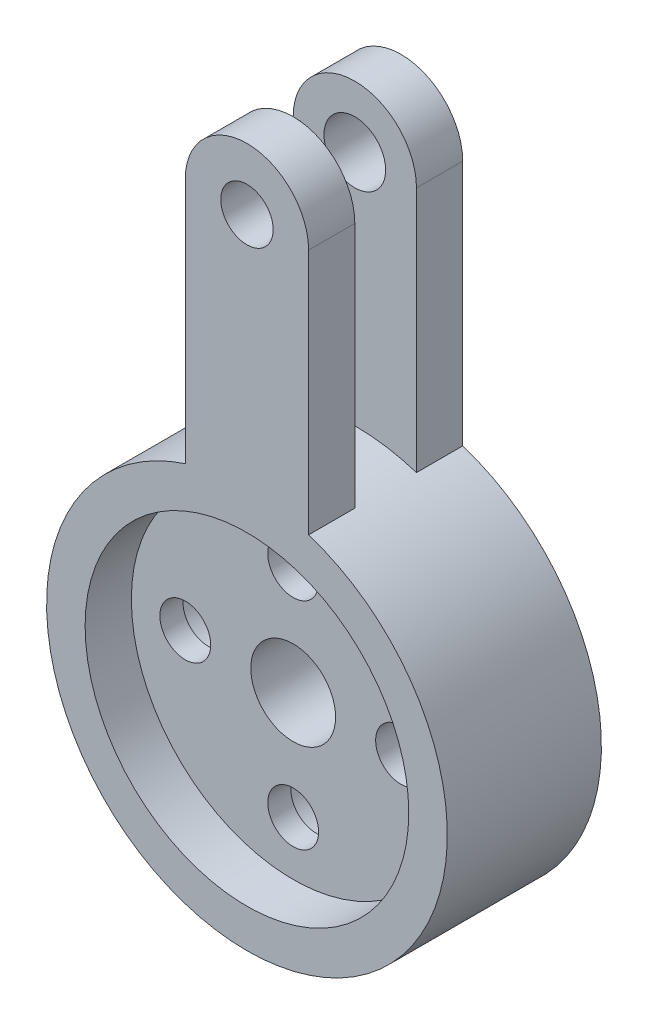
ISO-10303-21;
HEADER;
FILE_DESCRIPTION(('STEP AP214'),'2;1');
FILE_NAME('part.step','',(''),(''),'','','');
FILE_SCHEMA(('AUTOMOTIVE_DESIGN { 1 0 10303 214 1 1 1 1 }'));
ENDSEC;
DATA;
#1=APPLICATION_CONTEXT('core data for automotive mechanical design processes');
#2=APPLICATION_PROTOCOL_DEFINITION('international standard','automotive_design',2000,#1);
#3=PRODUCT_CONTEXT('',#1,'mechanical');
#4=PRODUCT('Part','Part','',(#3));
#5=PRODUCT_RELATED_PRODUCT_CATEGORY('part','',(#4));
#6=PRODUCT_DEFINITION_FORMATION('','',#4);
#7=PRODUCT_DEFINITION_CONTEXT('part definition',#1,'design');
#8=PRODUCT_DEFINITION('design','',#6,#7);
#9=PRODUCT_DEFINITION_SHAPE('','',#8);
#10=(LENGTH_UNIT() NAMED_UNIT(*) SI_UNIT(.MILLI.,.METRE.));
#11=(NAMED_UNIT(*) PLANE_ANGLE_UNIT() SI_UNIT($,.RADIAN.));
#12=(NAMED_UNIT(*) SI_UNIT($,.STERADIAN.) SOLID_ANGLE_UNIT());
#13=UNCERTAINTY_MEASURE_WITH_UNIT(LENGTH_MEASURE(1.E-05),#10,'distance_accuracy_value','');
#14=(GEOMETRIC_REPRESENTATION_CONTEXT(3) GLOBAL_UNCERTAINTY_ASSIGNED_CONTEXT((#13)) GLOBAL_UNIT_ASSIGNED_CONTEXT((#10,
#11,#12)) REPRESENTATION_CONTEXT('',''));
#15=CARTESIAN_POINT('',(0.,0.,0.));
#16=DIRECTION('',(0.,0.,1.));
#17=DIRECTION('',(1.,0.,0.));
#18=AXIS2_PLACEMENT_3D('',#15,#16,#17);
#19=CARTESIAN_POINT('',(0.,0.,10.));
#20=DIRECTION('',(0.,0.,-1.));
#21=DIRECTION('',(-1.,0.,0.));
#22=AXIS2_PLACEMENT_3D('',#19,#20,#21);
#23=CYLINDRICAL_SURFACE('',#22,13.);
#24=CARTESIAN_POINT('',(0.,0.,0.));
#25=DIRECTION('',(0.,0.,1.));
#26=DIRECTION('',(1.,0.,0.));
#27=AXIS2_PLACEMENT_3D('',#24,#25,#26);
#28=CIRCLE('',#27,13.);
#29=CARTESIAN_POINT('',(-4.,12.369316876853,0.));
#30=VERTEX_POINT('',#29);
#31=CARTESIAN_POINT('',(4.,12.369316876853,0.));
#32=VERTEX_POINT('',#31);
#33=EDGE_CURVE('E51',#30,#32,#28,.T.);
#34=ORIENTED_EDGE('',*,*,#33,.T.);
#35=DIRECTION('',(0.,0.,-1.));
#36=VECTOR('',#35,1.);
#37=CARTESIAN_POINT('',(4.,12.369316876853,3.));
#38=LINE('',#37,#36);
#39=CARTESIAN_POINT('',(4.,12.369316876853,3.));
#40=VERTEX_POINT('',#39);
#41=EDGE_CURVE('E154',#40,#32,#38,.T.);
#42=ORIENTED_EDGE('',*,*,#41,.F.);
#43=CARTESIAN_POINT('',(0.,-8.6389229103645E-13,3.));
#44=DIRECTION('',(0.,0.,1.));
#45=DIRECTION('',(1.,0.,0.));
#46=AXIS2_PLACEMENT_3D('',#43,#44,#45);
#47=CIRCLE('',#46,13.0000000000008);
#48=CARTESIAN_POINT('',(-4.,12.369316876853,3.));
#49=VERTEX_POINT('',#48);
#50=EDGE_CURVE('E133',#40,#49,#47,.T.);
#51=ORIENTED_EDGE('',*,*,#50,.T.);
#52=DIRECTION('',(0.,0.,-1.));
#53=VECTOR('',#52,1.);
#54=CARTESIAN_POINT('',(-4.,12.369316876853,3.));
#55=LINE('',#54,#53);
#56=EDGE_CURVE('E145',#49,#30,#55,.T.);
#57=ORIENTED_EDGE('',*,*,#56,.T.);
#58=EDGE_LOOP('',(#34,#42,#51,#57));
#59=FACE_BOUND('',#58,.T.);
#60=DIRECTION('',(0.,0.,1.));
#61=VECTOR('',#60,1.);
#62=CARTESIAN_POINT('',(-4.,12.369316876853,7.));
#63=LINE('',#62,#61);
#64=CARTESIAN_POINT('',(-4.,12.369316876853,7.));
#65=VERTEX_POINT('',#64);
#66=CARTESIAN_POINT('',(-4.,12.369316876853,10.));
#67=VERTEX_POINT('',#66);
#68=EDGE_CURVE('E59',#65,#67,#63,.T.);
#69=ORIENTED_EDGE('',*,*,#68,.F.);
#70=CARTESIAN_POINT('',(0.,-8.6389229103645E-13,7.));
#71=DIRECTION('',(0.,0.,1.));
#72=DIRECTION('',(1.,0.,0.));
#73=AXIS2_PLACEMENT_3D('',#70,#71,#72);
#74=CIRCLE('',#73,13.0000000000008);
#75=CARTESIAN_POINT('',(4.,12.369316876853,7.));
#76=VERTEX_POINT('',#75);
#77=EDGE_CURVE('E104',#76,#65,#74,.T.);
#78=ORIENTED_EDGE('',*,*,#77,.F.);
#79=DIRECTION('',(0.,0.,1.));
#80=VECTOR('',#79,1.);
#81=CARTESIAN_POINT('',(4.,12.369316876853,7.));
#82=LINE('',#81,#80);
#83=CARTESIAN_POINT('',(4.,12.369316876853,10.));
#84=VERTEX_POINT('',#83);
#85=EDGE_CURVE('E107',#76,#84,#82,.T.);
#86=ORIENTED_EDGE('',*,*,#85,.T.);
#87=CARTESIAN_POINT('',(0.,0.,10.));
#88=DIRECTION('',(0.,0.,1.));
#89=DIRECTION('',(1.,0.,0.));
#90=AXIS2_PLACEMENT_3D('',#87,#88,#89);
#91=CIRCLE('',#90,13.);
#92=EDGE_CURVE('E11',#67,#84,#91,.T.);
#93=ORIENTED_EDGE('',*,*,#92,.F.);
#94=EDGE_LOOP('',(#69,#78,#86,#93));
#95=FACE_BOUND('',#94,.T.);
#96=ADVANCED_FACE('F43',(#59,#95),#23,.T.);
#97=CARTESIAN_POINT('',(-7.,0.,10.));
#98=DIRECTION('',(0.,0.,-1.));
#99=DIRECTION('',(-1.,0.,0.));
#100=AXIS2_PLACEMENT_3D('',#97,#98,#99);
#101=CYLINDRICAL_SURFACE('',#100,1.65);
#102=CARTESIAN_POINT('',(-7.,0.,7.));
#103=DIRECTION('',(0.,0.,1.));
#104=DIRECTION('',(1.,0.,0.));
#105=AXIS2_PLACEMENT_3D('',#102,#103,#104);
#106=CIRCLE('',#105,1.65);
#107=CARTESIAN_POINT('',(-5.35,0.,7.));
#108=VERTEX_POINT('',#107);
#109=EDGE_CURVE('E201',#108,#108,#106,.T.);
#110=ORIENTED_EDGE('',*,*,#109,.T.);
#111=EDGE_LOOP('',(#110));
#112=FACE_BOUND('',#111,.T.);
#113=CARTESIAN_POINT('',(-7.,0.,5.5));
#114=DIRECTION('',(0.,0.,-1.));
#115=DIRECTION('',(-1.,0.,0.));
#116=AXIS2_PLACEMENT_3D('',#113,#114,#115);
#117=CIRCLE('',#116,1.65);
#118=CARTESIAN_POINT('',(-8.65,0.,5.5));
#119=VERTEX_POINT('',#118);
#120=EDGE_CURVE('E46',#119,#119,#117,.T.);
#121=ORIENTED_EDGE('',*,*,#120,.T.);
#122=EDGE_LOOP('',(#121));
#123=FACE_BOUND('',#122,.T.);
#124=ADVANCED_FACE('F224',(#112,#123),#101,.F.);
#125=CARTESIAN_POINT('',(0.,7.,10.));
#126=DIRECTION('',(0.,0.,-1.));
#127=DIRECTION('',(-1.,0.,0.));
#128=AXIS2_PLACEMENT_3D('',#125,#126,#127);
#129=CYLINDRICAL_SURFACE('',#128,1.65);
#130=CARTESIAN_POINT('',(0.,7.,7.));
#131=DIRECTION('',(0.,0.,1.));
#132=DIRECTION('',(1.,0.,0.));
#133=AXIS2_PLACEMENT_3D('',#130,#131,#132);
#134=CIRCLE('',#133,1.65);
#135=CARTESIAN_POINT('',(1.65000000000003,7.,7.));
#136=VERTEX_POINT('',#135);
#137=EDGE_CURVE('E198',#136,#136,#134,.T.);
#138=ORIENTED_EDGE('',*,*,#137,.T.);
#139=EDGE_LOOP('',(#138));
#140=FACE_BOUND('',#139,.T.);
#141=CARTESIAN_POINT('',(0.,7.,5.5));
#142=DIRECTION('',(0.,0.,-1.));
#143=DIRECTION('',(-1.,0.,0.));
#144=AXIS2_PLACEMENT_3D('',#141,#142,#143);
#145=CIRCLE('',#144,1.65);
#146=CARTESIAN_POINT('',(-1.64999999999998,7.,5.5));
#147=VERTEX_POINT('',#146);
#148=EDGE_CURVE('E217',#147,#147,#145,.T.);
#149=ORIENTED_EDGE('',*,*,#148,.T.);
#150=EDGE_LOOP('',(#149));
#151=FACE_BOUND('',#150,.T.);
#152=ADVANCED_FACE('F323',(#140,#151),#129,.F.);
#153=CARTESIAN_POINT('',(7.,0.,10.));
#154=DIRECTION('',(0.,0.,-1.));
#155=DIRECTION('',(-1.,0.,0.));
#156=AXIS2_PLACEMENT_3D('',#153,#154,#155);
#157=CYLINDRICAL_SURFACE('',#156,1.65);
#158=CARTESIAN_POINT('',(7.,0.,7.));
#159=DIRECTION('',(0.,0.,1.));
#160=DIRECTION('',(1.,0.,0.));
#161=AXIS2_PLACEMENT_3D('',#158,#159,#160);
#162=CIRCLE('',#161,1.65);
#163=CARTESIAN_POINT('',(8.65,0.,7.));
#164=VERTEX_POINT('',#163);
#165=EDGE_CURVE('E195',#164,#164,#162,.T.);
#166=ORIENTED_EDGE('',*,*,#165,.T.);
#167=EDGE_LOOP('',(#166));
#168=FACE_BOUND('',#167,.T.);
#169=CARTESIAN_POINT('',(7.,0.,5.5));
#170=DIRECTION('',(0.,0.,-1.));
#171=DIRECTION('',(-1.,0.,0.));
#172=AXIS2_PLACEMENT_3D('',#169,#170,#171);
#173=CIRCLE('',#172,1.65);
#174=CARTESIAN_POINT('',(5.35,0.,5.5));
#175=VERTEX_POINT('',#174);
#176=EDGE_CURVE('E215',#175,#175,#173,.T.);
#177=ORIENTED_EDGE('',*,*,#176,.T.);
#178=EDGE_LOOP('',(#177));
#179=FACE_BOUND('',#178,.T.);
#180=ADVANCED_FACE('F374',(#168,#179),#157,.F.);
#181=CARTESIAN_POINT('',(0.,-7.,10.));
#182=DIRECTION('',(0.,0.,-1.));
#183=DIRECTION('',(-1.,0.,0.));
#184=AXIS2_PLACEMENT_3D('',#181,#182,#183);
#185=CYLINDRICAL_SURFACE('',#184,1.65);
#186=CARTESIAN_POINT('',(0.,-7.,7.));
#187=DIRECTION('',(0.,0.,1.));
#188=DIRECTION('',(1.,0.,0.));
#189=AXIS2_PLACEMENT_3D('',#186,#187,#188);
#190=CIRCLE('',#189,1.65);
#191=CARTESIAN_POINT('',(1.64999999999993,-7.,7.));
#192=VERTEX_POINT('',#191);
#193=EDGE_CURVE('E191',#192,#192,#190,.T.);
#194=ORIENTED_EDGE('',*,*,#193,.T.);
#195=EDGE_LOOP('',(#194));
#196=FACE_BOUND('',#195,.T.);
#197=CARTESIAN_POINT('',(0.,-7.,5.5));
#198=DIRECTION('',(0.,0.,-1.));
#199=DIRECTION('',(-1.,0.,0.));
#200=AXIS2_PLACEMENT_3D('',#197,#198,#199);
#201=CIRCLE('',#200,1.65);
#202=CARTESIAN_POINT('',(-1.65000000000007,-7.,5.5));
#203=VERTEX_POINT('',#202);
#204=EDGE_CURVE('E167',#203,#203,#201,.T.);
#205=ORIENTED_EDGE('',*,*,#204,.T.);
#206=EDGE_LOOP('',(#205));
#207=FACE_BOUND('',#206,.T.);
#208=ADVANCED_FACE('F254',(#196,#207),#185,.F.);
#209=CARTESIAN_POINT('',(0.,0.,10.));
#210=DIRECTION('',(0.,0.,-1.));
#211=DIRECTION('',(-1.,0.,0.));
#212=AXIS2_PLACEMENT_3D('',#209,#210,#211);
#213=CYLINDRICAL_SURFACE('',#212,2.75);
#214=CARTESIAN_POINT('',(0.,0.,0.));
#215=DIRECTION('',(0.,0.,1.));
#216=DIRECTION('',(1.,0.,0.));
#217=AXIS2_PLACEMENT_3D('',#214,#215,#216);
#218=CIRCLE('',#217,2.75);
#219=CARTESIAN_POINT('',(2.75,0.,0.));
#220=VERTEX_POINT('',#219);
#221=EDGE_CURVE('E207',#220,#220,#218,.T.);
#222=ORIENTED_EDGE('',*,*,#221,.F.);
#223=EDGE_LOOP('',(#222));
#224=FACE_BOUND('',#223,.T.);
#225=CARTESIAN_POINT('',(0.,0.,7.));
#226=DIRECTION('',(0.,0.,1.));
#227=DIRECTION('',(1.,0.,0.));
#228=AXIS2_PLACEMENT_3D('',#225,#226,#227);
#229=CIRCLE('',#228,2.75);
#230=CARTESIAN_POINT('',(2.75,0.,7.));
#231=VERTEX_POINT('',#230);
#232=EDGE_CURVE('E204',#231,#231,#229,.T.);
#233=ORIENTED_EDGE('',*,*,#232,.T.);
#234=EDGE_LOOP('',(#233));
#235=FACE_BOUND('',#234,.T.);
#236=ADVANCED_FACE('F251',(#224,#235),#213,.F.);
#237=CARTESIAN_POINT('',(0.,0.,10.));
#238=DIRECTION('',(0.,0.,1.));
#239=DIRECTION('',(1.,0.,0.));
#240=AXIS2_PLACEMENT_3D('',#237,#238,#239);
#241=PLANE('',#240);
#242=CARTESIAN_POINT('',(0.,0.,10.));
#243=DIRECTION('',(0.,0.,1.));
#244=DIRECTION('',(1.,0.,0.));
#245=AXIS2_PLACEMENT_3D('',#242,#243,#244);
#246=CIRCLE('',#245,10.5);
#247=CARTESIAN_POINT('',(10.5,0.,10.));
#248=VERTEX_POINT('',#247);
#249=EDGE_CURVE('E192',#248,#248,#246,.T.);
#250=ORIENTED_EDGE('',*,*,#249,.F.);
#251=EDGE_LOOP('',(#250));
#252=FACE_BOUND('',#251,.T.);
#253=ORIENTED_EDGE('',*,*,#92,.T.);
#254=DIRECTION('',(0.,-1.,0.));
#255=VECTOR('',#254,1.);
#256=CARTESIAN_POINT('',(4.,28.369316876853,10.));
#257=LINE('',#256,#255);
#258=CARTESIAN_POINT('',(4.,28.369316876853,10.));
#259=VERTEX_POINT('',#258);
#260=EDGE_CURVE('E124',#259,#84,#257,.T.);
#261=ORIENTED_EDGE('',*,*,#260,.F.);
#262=CARTESIAN_POINT('',(0.,28.369316876853,10.));
#263=DIRECTION('',(0.,0.,-1.));
#264=DIRECTION('',(1.,0.,0.));
#265=AXIS2_PLACEMENT_3D('',#262,#263,#264);
#266=CIRCLE('',#265,4.);
#267=CARTESIAN_POINT('',(-4.,28.369316876853,10.));
#268=VERTEX_POINT('',#267);
#269=EDGE_CURVE('E298',#268,#259,#266,.T.);
#270=ORIENTED_EDGE('',*,*,#269,.F.);
#271=DIRECTION('',(0.,1.,0.));
#272=VECTOR('',#271,1.);
#273=CARTESIAN_POINT('',(-4.,28.369316876853,10.));
#274=LINE('',#273,#272);
#275=EDGE_CURVE('E110',#67,#268,#274,.T.);
#276=ORIENTED_EDGE('',*,*,#275,.F.);
#277=EDGE_LOOP('',(#253,#261,#270,#276));
#278=FACE_BOUND('',#277,.T.);
#279=CARTESIAN_POINT('',(0.,28.369316876853,10.));
#280=DIRECTION('',(0.,0.,-1.));
#281=DIRECTION('',(-1.,0.,0.));
#282=AXIS2_PLACEMENT_3D('',#279,#280,#281);
#283=CIRCLE('',#282,1.7);
#284=CARTESIAN_POINT('',(-1.7,28.369316876853,10.));
#285=VERTEX_POINT('',#284);
#286=EDGE_CURVE('E284',#285,#285,#283,.T.);
#287=ORIENTED_EDGE('',*,*,#286,.T.);
#288=EDGE_LOOP('',(#287));
#289=FACE_BOUND('',#288,.T.);
#290=ADVANCED_FACE('F244',(#252,#278,#289),#241,.T.);
#291=CARTESIAN_POINT('',(0.,0.,0.));
#292=DIRECTION('',(0.,0.,1.));
#293=DIRECTION('',(1.,0.,0.));
#294=AXIS2_PLACEMENT_3D('',#291,#292,#293);
#295=PLANE('',#294);
#296=CARTESIAN_POINT('',(0.,28.369316876853,0.));
#297=DIRECTION('',(0.,0.,-1.));
#298=DIRECTION('',(-1.,0.,0.));
#299=AXIS2_PLACEMENT_3D('',#296,#297,#298);
#300=CIRCLE('',#299,2.);
#301=CARTESIAN_POINT('',(-2.,28.369316876853,0.));
#302=VERTEX_POINT('',#301);
#303=EDGE_CURVE('E292',#302,#302,#300,.T.);
#304=ORIENTED_EDGE('',*,*,#303,.F.);
#305=EDGE_LOOP('',(#304));
#306=FACE_BOUND('',#305,.T.);
#307=CARTESIAN_POINT('',(7.,0.,0.));
#308=DIRECTION('',(0.,0.,-1.));
#309=DIRECTION('',(-1.,0.,0.));
#310=AXIS2_PLACEMENT_3D('',#307,#308,#309);
#311=CIRCLE('',#310,2.75);
#312=CARTESIAN_POINT('',(4.25,0.,0.));
#313=VERTEX_POINT('',#312);
#314=EDGE_CURVE('E168',#313,#313,#311,.T.);
#315=ORIENTED_EDGE('',*,*,#314,.F.);
#316=EDGE_LOOP('',(#315));
#317=FACE_BOUND('',#316,.T.);
#318=CARTESIAN_POINT('',(0.,7.,0.));
#319=DIRECTION('',(0.,0.,-1.));
#320=DIRECTION('',(-1.,0.,0.));
#321=AXIS2_PLACEMENT_3D('',#318,#319,#320);
#322=CIRCLE('',#321,2.75);
#323=CARTESIAN_POINT('',(-2.74999999999998,7.,0.));
#324=VERTEX_POINT('',#323);
#325=EDGE_CURVE('E171',#324,#324,#322,.T.);
#326=ORIENTED_EDGE('',*,*,#325,.F.);
#327=EDGE_LOOP('',(#326));
#328=FACE_BOUND('',#327,.T.);
#329=CARTESIAN_POINT('',(-7.,0.,0.));
#330=DIRECTION('',(0.,0.,-1.));
#331=DIRECTION('',(-1.,0.,0.));
#332=AXIS2_PLACEMENT_3D('',#329,#330,#331);
#333=CIRCLE('',#332,2.75);
#334=CARTESIAN_POINT('',(-9.75,0.,0.));
#335=VERTEX_POINT('',#334);
#336=EDGE_CURVE('E177',#335,#335,#333,.T.);
#337=ORIENTED_EDGE('',*,*,#336,.F.);
#338=EDGE_LOOP('',(#337));
#339=FACE_BOUND('',#338,.T.);
#340=CARTESIAN_POINT('',(0.,-7.,0.));
#341=DIRECTION('',(0.,0.,-1.));
#342=DIRECTION('',(-1.,0.,0.));
#343=AXIS2_PLACEMENT_3D('',#340,#341,#342);
#344=CIRCLE('',#343,2.75);
#345=CARTESIAN_POINT('',(-2.75000000000007,-7.,0.));
#346=VERTEX_POINT('',#345);
#347=EDGE_CURVE('E183',#346,#346,#344,.T.);
#348=ORIENTED_EDGE('',*,*,#347,.F.);
#349=EDGE_LOOP('',(#348));
#350=FACE_BOUND('',#349,.T.);
#351=ORIENTED_EDGE('',*,*,#33,.F.);
#352=DIRECTION('',(0.,1.,0.));
#353=VECTOR('',#352,1.);
#354=CARTESIAN_POINT('',(-4.,28.369316876853,0.));
#355=LINE('',#354,#353);
#356=CARTESIAN_POINT('',(-4.,28.369316876853,0.));
#357=VERTEX_POINT('',#356);
#358=EDGE_CURVE('E146',#30,#357,#355,.T.);
#359=ORIENTED_EDGE('',*,*,#358,.T.);
#360=CARTESIAN_POINT('',(0.,28.369316876853,0.));
#361=DIRECTION('',(0.,0.,-1.));
#362=DIRECTION('',(1.,0.,0.));
#363=AXIS2_PLACEMENT_3D('',#360,#361,#362);
#364=CIRCLE('',#363,4.);
#365=CARTESIAN_POINT('',(4.,28.369316876853,0.));
#366=VERTEX_POINT('',#365);
#367=EDGE_CURVE('E149',#357,#366,#364,.T.);
#368=ORIENTED_EDGE('',*,*,#367,.T.);
#369=DIRECTION('',(0.,-1.,0.));
#370=VECTOR('',#369,1.);
#371=CARTESIAN_POINT('',(4.,28.369316876853,0.));
#372=LINE('',#371,#370);
#373=EDGE_CURVE('E136',#366,#32,#372,.T.);
#374=ORIENTED_EDGE('',*,*,#373,.T.);
#375=EDGE_LOOP('',(#351,#359,#368,#374));
#376=FACE_BOUND('',#375,.T.);
#377=ORIENTED_EDGE('',*,*,#221,.T.);
#378=EDGE_LOOP('',(#377));
#379=FACE_BOUND('',#378,.T.);
#380=ADVANCED_FACE('F240',(#306,#317,#328,#339,#350,#376,#379),#295,.F.);
#381=CARTESIAN_POINT('',(0.,0.,7.));
#382=DIRECTION('',(0.,0.,1.));
#383=DIRECTION('',(1.,0.,0.));
#384=AXIS2_PLACEMENT_3D('',#381,#382,#383);
#385=CYLINDRICAL_SURFACE('',#384,10.5);
#386=CARTESIAN_POINT('',(0.,0.,7.));
#387=DIRECTION('',(0.,0.,1.));
#388=DIRECTION('',(1.,0.,0.));
#389=AXIS2_PLACEMENT_3D('',#386,#387,#388);
#390=CIRCLE('',#389,10.5);
#391=CARTESIAN_POINT('',(10.5,0.,7.));
#392=VERTEX_POINT('',#391);
#393=EDGE_CURVE('E188',#392,#392,#390,.T.);
#394=ORIENTED_EDGE('',*,*,#393,.F.);
#395=EDGE_LOOP('',(#394));
#396=FACE_BOUND('',#395,.T.);
#397=ORIENTED_EDGE('',*,*,#249,.T.);
#398=EDGE_LOOP('',(#397));
#399=FACE_BOUND('',#398,.T.);
#400=ADVANCED_FACE('F243',(#396,#399),#385,.F.);
#401=CARTESIAN_POINT('',(0.,0.,7.));
#402=DIRECTION('',(0.,0.,1.));
#403=DIRECTION('',(1.,0.,0.));
#404=AXIS2_PLACEMENT_3D('',#401,#402,#403);
#405=PLANE('',#404);
#406=ORIENTED_EDGE('',*,*,#232,.F.);
#407=EDGE_LOOP('',(#406));
#408=FACE_BOUND('',#407,.T.);
#409=ORIENTED_EDGE('',*,*,#109,.F.);
#410=EDGE_LOOP('',(#409));
#411=FACE_BOUND('',#410,.T.);
#412=ORIENTED_EDGE('',*,*,#137,.F.);
#413=EDGE_LOOP('',(#412));
#414=FACE_BOUND('',#413,.T.);
#415=ORIENTED_EDGE('',*,*,#165,.F.);
#416=EDGE_LOOP('',(#415));
#417=FACE_BOUND('',#416,.T.);
#418=ORIENTED_EDGE('',*,*,#193,.F.);
#419=EDGE_LOOP('',(#418));
#420=FACE_BOUND('',#419,.T.);
#421=ORIENTED_EDGE('',*,*,#393,.T.);
#422=EDGE_LOOP('',(#421));
#423=FACE_BOUND('',#422,.T.);
#424=ADVANCED_FACE('F258',(#408,#411,#414,#417,#420,#423),#405,.T.);
#425=CARTESIAN_POINT('',(0.,-7.,5.5));
#426=DIRECTION('',(0.,0.,-1.));
#427=DIRECTION('',(-1.,0.,0.));
#428=AXIS2_PLACEMENT_3D('',#425,#426,#427);
#429=CYLINDRICAL_SURFACE('',#428,2.75);
#430=CARTESIAN_POINT('',(0.,-7.,5.5));
#431=DIRECTION('',(0.,0.,-1.));
#432=DIRECTION('',(-1.,0.,0.));
#433=AXIS2_PLACEMENT_3D('',#430,#431,#432);
#434=CIRCLE('',#433,2.75);
#435=CARTESIAN_POINT('',(-2.75000000000007,-7.,5.5));
#436=VERTEX_POINT('',#435);
#437=EDGE_CURVE('E157',#436,#436,#434,.T.);
#438=ORIENTED_EDGE('',*,*,#437,.F.);
#439=EDGE_LOOP('',(#438));
#440=FACE_BOUND('',#439,.T.);
#441=ORIENTED_EDGE('',*,*,#347,.T.);
#442=EDGE_LOOP('',(#441));
#443=FACE_BOUND('',#442,.T.);
#444=ADVANCED_FACE('F261',(#440,#443),#429,.F.);
#445=CARTESIAN_POINT('',(0.,-7.,5.5));
#446=DIRECTION('',(0.,0.,-1.));
#447=DIRECTION('',(-1.,0.,0.));
#448=AXIS2_PLACEMENT_3D('',#445,#446,#447);
#449=PLANE('',#448);
#450=ORIENTED_EDGE('',*,*,#204,.F.);
#451=EDGE_LOOP('',(#450));
#452=FACE_BOUND('',#451,.T.);
#453=ORIENTED_EDGE('',*,*,#437,.T.);
#454=EDGE_LOOP('',(#453));
#455=FACE_BOUND('',#454,.T.);
#456=ADVANCED_FACE('F236',(#452,#455),#449,.T.);
#457=CARTESIAN_POINT('',(-7.,0.,5.5));
#458=DIRECTION('',(0.,0.,-1.));
#459=DIRECTION('',(-1.,0.,0.));
#460=AXIS2_PLACEMENT_3D('',#457,#458,#459);
#461=CYLINDRICAL_SURFACE('',#460,2.75);
#462=CARTESIAN_POINT('',(-7.,0.,5.5));
#463=DIRECTION('',(0.,0.,-1.));
#464=DIRECTION('',(-1.,0.,0.));
#465=AXIS2_PLACEMENT_3D('',#462,#463,#464);
#466=CIRCLE('',#465,2.75);
#467=CARTESIAN_POINT('',(-9.75,0.,5.5));
#468=VERTEX_POINT('',#467);
#469=EDGE_CURVE('E180',#468,#468,#466,.T.);
#470=ORIENTED_EDGE('',*,*,#469,.F.);
#471=EDGE_LOOP('',(#470));
#472=FACE_BOUND('',#471,.T.);
#473=ORIENTED_EDGE('',*,*,#336,.T.);
#474=EDGE_LOOP('',(#473));
#475=FACE_BOUND('',#474,.T.);
#476=ADVANCED_FACE('F230',(#472,#475),#461,.F.);
#477=CARTESIAN_POINT('',(-7.,0.,5.5));
#478=DIRECTION('',(0.,0.,-1.));
#479=DIRECTION('',(-1.,0.,0.));
#480=AXIS2_PLACEMENT_3D('',#477,#478,#479);
#481=PLANE('',#480);
#482=ORIENTED_EDGE('',*,*,#120,.F.);
#483=EDGE_LOOP('',(#482));
#484=FACE_BOUND('',#483,.T.);
#485=ORIENTED_EDGE('',*,*,#469,.T.);
#486=EDGE_LOOP('',(#485));
#487=FACE_BOUND('',#486,.T.);
#488=ADVANCED_FACE('F226',(#484,#487),#481,.T.);
#489=CARTESIAN_POINT('',(0.,7.,5.5));
#490=DIRECTION('',(0.,0.,-1.));
#491=DIRECTION('',(-1.,0.,0.));
#492=AXIS2_PLACEMENT_3D('',#489,#490,#491);
#493=CYLINDRICAL_SURFACE('',#492,2.75);
#494=CARTESIAN_POINT('',(0.,7.,5.5));
#495=DIRECTION('',(0.,0.,-1.));
#496=DIRECTION('',(-1.,0.,0.));
#497=AXIS2_PLACEMENT_3D('',#494,#495,#496);
#498=CIRCLE('',#497,2.75);
#499=CARTESIAN_POINT('',(-2.74999999999998,7.,5.5));
#500=VERTEX_POINT('',#499);
#501=EDGE_CURVE('E174',#500,#500,#498,.T.);
#502=ORIENTED_EDGE('',*,*,#501,.F.);
#503=EDGE_LOOP('',(#502));
#504=FACE_BOUND('',#503,.T.);
#505=ORIENTED_EDGE('',*,*,#325,.T.);
#506=EDGE_LOOP('',(#505));
#507=FACE_BOUND('',#506,.T.);
#508=ADVANCED_FACE('F229',(#504,#507),#493,.F.);
#509=CARTESIAN_POINT('',(0.,7.,5.5));
#510=DIRECTION('',(0.,0.,-1.));
#511=DIRECTION('',(-1.,0.,0.));
#512=AXIS2_PLACEMENT_3D('',#509,#510,#511);
#513=PLANE('',#512);
#514=ORIENTED_EDGE('',*,*,#148,.F.);
#515=EDGE_LOOP('',(#514));
#516=FACE_BOUND('',#515,.T.);
#517=ORIENTED_EDGE('',*,*,#501,.T.);
#518=EDGE_LOOP('',(#517));
#519=FACE_BOUND('',#518,.T.);
#520=ADVANCED_FACE('F358',(#516,#519),#513,.T.);
#521=CARTESIAN_POINT('',(7.,0.,5.5));
#522=DIRECTION('',(0.,0.,-1.));
#523=DIRECTION('',(-1.,0.,0.));
#524=AXIS2_PLACEMENT_3D('',#521,#522,#523);
#525=CYLINDRICAL_SURFACE('',#524,2.75);
#526=CARTESIAN_POINT('',(7.,0.,5.5));
#527=DIRECTION('',(0.,0.,-1.));
#528=DIRECTION('',(-1.,0.,0.));
#529=AXIS2_PLACEMENT_3D('',#526,#527,#528);
#530=CIRCLE('',#529,2.75);
#531=CARTESIAN_POINT('',(4.25,0.,5.5));
#532=VERTEX_POINT('',#531);
#533=EDGE_CURVE('E164',#532,#532,#530,.T.);
#534=ORIENTED_EDGE('',*,*,#533,.F.);
#535=EDGE_LOOP('',(#534));
#536=FACE_BOUND('',#535,.T.);
#537=ORIENTED_EDGE('',*,*,#314,.T.);
#538=EDGE_LOOP('',(#537));
#539=FACE_BOUND('',#538,.T.);
#540=ADVANCED_FACE('F354',(#536,#539),#525,.F.);
#541=CARTESIAN_POINT('',(7.,0.,5.5));
#542=DIRECTION('',(0.,0.,-1.));
#543=DIRECTION('',(-1.,0.,0.));
#544=AXIS2_PLACEMENT_3D('',#541,#542,#543);
#545=PLANE('',#544);
#546=ORIENTED_EDGE('',*,*,#176,.F.);
#547=EDGE_LOOP('',(#546));
#548=FACE_BOUND('',#547,.T.);
#549=ORIENTED_EDGE('',*,*,#533,.T.);
#550=EDGE_LOOP('',(#549));
#551=FACE_BOUND('',#550,.T.);
#552=ADVANCED_FACE('F351',(#548,#551),#545,.T.);
#553=CARTESIAN_POINT('',(4.,28.369316876853,3.));
#554=DIRECTION('',(1.,0.,0.));
#555=DIRECTION('',(0.,0.,-1.));
#556=AXIS2_PLACEMENT_3D('',#553,#554,#555);
#557=PLANE('',#556);
#558=ORIENTED_EDGE('',*,*,#373,.F.);
#559=DIRECTION('',(0.,0.,-1.));
#560=VECTOR('',#559,1.);
#561=CARTESIAN_POINT('',(4.,28.369316876853,3.));
#562=LINE('',#561,#560);
#563=CARTESIAN_POINT('',(4.,28.369316876853,3.));
#564=VERTEX_POINT('',#563);
#565=EDGE_CURVE('E158',#564,#366,#562,.T.);
#566=ORIENTED_EDGE('',*,*,#565,.F.);
#567=DIRECTION('',(0.,-1.,0.));
#568=VECTOR('',#567,1.);
#569=CARTESIAN_POINT('',(4.,28.369316876853,3.));
#570=LINE('',#569,#568);
#571=EDGE_CURVE('E142',#564,#40,#570,.T.);
#572=ORIENTED_EDGE('',*,*,#571,.T.);
#573=ORIENTED_EDGE('',*,*,#41,.T.);
#574=EDGE_LOOP('',(#558,#566,#572,#573));
#575=FACE_BOUND('',#574,.T.);
#576=ADVANCED_FACE('F331',(#575),#557,.T.);
#577=CARTESIAN_POINT('',(0.,28.369316876853,3.));
#578=DIRECTION('',(0.,0.,-1.));
#579=DIRECTION('',(-1.,0.,0.));
#580=AXIS2_PLACEMENT_3D('',#577,#578,#579);
#581=CYLINDRICAL_SURFACE('',#580,4.);
#582=ORIENTED_EDGE('',*,*,#367,.F.);
#583=DIRECTION('',(0.,0.,-1.));
#584=VECTOR('',#583,1.);
#585=CARTESIAN_POINT('',(-4.,28.369316876853,3.));
#586=LINE('',#585,#584);
#587=CARTESIAN_POINT('',(-4.,28.369316876853,3.));
#588=VERTEX_POINT('',#587);
#589=EDGE_CURVE('E160',#588,#357,#586,.T.);
#590=ORIENTED_EDGE('',*,*,#589,.F.);
#591=CARTESIAN_POINT('',(0.,28.369316876853,3.));
#592=DIRECTION('',(0.,0.,-1.));
#593=DIRECTION('',(1.,0.,0.));
#594=AXIS2_PLACEMENT_3D('',#591,#592,#593);
#595=CIRCLE('',#594,4.);
#596=EDGE_CURVE('E139',#588,#564,#595,.T.);
#597=ORIENTED_EDGE('',*,*,#596,.T.);
#598=ORIENTED_EDGE('',*,*,#565,.T.);
#599=EDGE_LOOP('',(#582,#590,#597,#598));
#600=FACE_BOUND('',#599,.T.);
#601=ADVANCED_FACE('F335',(#600),#581,.T.);
#602=CARTESIAN_POINT('',(-4.,28.369316876853,3.));
#603=DIRECTION('',(-1.,0.,0.));
#604=DIRECTION('',(0.,0.,1.));
#605=AXIS2_PLACEMENT_3D('',#602,#603,#604);
#606=PLANE('',#605);
#607=ORIENTED_EDGE('',*,*,#358,.F.);
#608=ORIENTED_EDGE('',*,*,#56,.F.);
#609=DIRECTION('',(0.,1.,0.));
#610=VECTOR('',#609,1.);
#611=CARTESIAN_POINT('',(-4.,28.369316876853,3.));
#612=LINE('',#611,#610);
#613=EDGE_CURVE('E135',#49,#588,#612,.T.);
#614=ORIENTED_EDGE('',*,*,#613,.T.);
#615=ORIENTED_EDGE('',*,*,#589,.T.);
#616=EDGE_LOOP('',(#607,#608,#614,#615));
#617=FACE_BOUND('',#616,.T.);
#618=ADVANCED_FACE('F340',(#617),#606,.T.);
#619=CARTESIAN_POINT('',(0.,-8.6389229103645E-13,3.));
#620=DIRECTION('',(0.,0.,1.));
#621=DIRECTION('',(1.,0.,0.));
#622=AXIS2_PLACEMENT_3D('',#619,#620,#621);
#623=PLANE('',#622);
#624=CARTESIAN_POINT('',(0.,28.369316876853,3.));
#625=DIRECTION('',(0.,0.,-1.));
#626=DIRECTION('',(-1.,0.,0.));
#627=AXIS2_PLACEMENT_3D('',#624,#625,#626);
#628=CIRCLE('',#627,2.);
#629=CARTESIAN_POINT('',(-2.,28.369316876853,3.));
#630=VERTEX_POINT('',#629);
#631=EDGE_CURVE('E287',#630,#630,#628,.T.);
#632=ORIENTED_EDGE('',*,*,#631,.T.);
#633=EDGE_LOOP('',(#632));
#634=FACE_BOUND('',#633,.T.);
#635=ORIENTED_EDGE('',*,*,#50,.F.);
#636=ORIENTED_EDGE('',*,*,#571,.F.);
#637=ORIENTED_EDGE('',*,*,#596,.F.);
#638=ORIENTED_EDGE('',*,*,#613,.F.);
#639=EDGE_LOOP('',(#635,#636,#637,#638));
#640=FACE_BOUND('',#639,.T.);
#641=ADVANCED_FACE('F315',(#634,#640),#623,.T.);
#642=CARTESIAN_POINT('',(0.,-8.6389229103645E-13,7.));
#643=DIRECTION('',(0.,0.,-1.));
#644=DIRECTION('',(1.,0.,0.));
#645=AXIS2_PLACEMENT_3D('',#642,#643,#644);
#646=PLANE('',#645);
#647=ORIENTED_EDGE('',*,*,#77,.T.);
#648=DIRECTION('',(0.,1.,0.));
#649=VECTOR('',#648,1.);
#650=CARTESIAN_POINT('',(-4.,28.369316876853,7.));
#651=LINE('',#650,#649);
#652=CARTESIAN_POINT('',(-4.,28.369316876853,7.));
#653=VERTEX_POINT('',#652);
#654=EDGE_CURVE('E126',#65,#653,#651,.T.);
#655=ORIENTED_EDGE('',*,*,#654,.T.);
#656=CARTESIAN_POINT('',(0.,28.369316876853,7.));
#657=DIRECTION('',(0.,0.,-1.));
#658=DIRECTION('',(1.,0.,0.));
#659=AXIS2_PLACEMENT_3D('',#656,#657,#658);
#660=CIRCLE('',#659,4.);
#661=CARTESIAN_POINT('',(4.,28.369316876853,7.));
#662=VERTEX_POINT('',#661);
#663=EDGE_CURVE('E116',#653,#662,#660,.T.);
#664=ORIENTED_EDGE('',*,*,#663,.T.);
#665=DIRECTION('',(0.,-1.,0.));
#666=VECTOR('',#665,1.);
#667=CARTESIAN_POINT('',(4.,28.369316876853,7.));
#668=LINE('',#667,#666);
#669=EDGE_CURVE('E109',#662,#76,#668,.T.);
#670=ORIENTED_EDGE('',*,*,#669,.T.);
#671=EDGE_LOOP('',(#647,#655,#664,#670));
#672=FACE_BOUND('',#671,.T.);
#673=CARTESIAN_POINT('',(0.,28.369316876853,7.));
#674=DIRECTION('',(0.,0.,-1.));
#675=DIRECTION('',(-1.,0.,0.));
#676=AXIS2_PLACEMENT_3D('',#673,#674,#675);
#677=CIRCLE('',#676,1.7);
#678=CARTESIAN_POINT('',(-1.7,28.369316876853,7.));
#679=VERTEX_POINT('',#678);
#680=EDGE_CURVE('E286',#679,#679,#677,.T.);
#681=ORIENTED_EDGE('',*,*,#680,.F.);
#682=EDGE_LOOP('',(#681));
#683=FACE_BOUND('',#682,.T.);
#684=ADVANCED_FACE('F113',(#672,#683),#646,.T.);
#685=CARTESIAN_POINT('',(-4.,28.369316876853,7.));
#686=DIRECTION('',(1.,0.,0.));
#687=DIRECTION('',(0.,0.,-1.));
#688=AXIS2_PLACEMENT_3D('',#685,#686,#687);
#689=PLANE('',#688);
#690=ORIENTED_EDGE('',*,*,#275,.T.);
#691=DIRECTION('',(0.,0.,1.));
#692=VECTOR('',#691,1.);
#693=CARTESIAN_POINT('',(-4.,28.369316876853,7.));
#694=LINE('',#693,#692);
#695=EDGE_CURVE('E128',#653,#268,#694,.T.);
#696=ORIENTED_EDGE('',*,*,#695,.F.);
#697=ORIENTED_EDGE('',*,*,#654,.F.);
#698=ORIENTED_EDGE('',*,*,#68,.T.);
#699=EDGE_LOOP('',(#690,#696,#697,#698));
#700=FACE_BOUND('',#699,.T.);
#701=ADVANCED_FACE('F307',(#700),#689,.F.);
#702=CARTESIAN_POINT('',(0.,28.369316876853,7.));
#703=DIRECTION('',(0.,0.,1.));
#704=DIRECTION('',(1.,0.,0.));
#705=AXIS2_PLACEMENT_3D('',#702,#703,#704);
#706=CYLINDRICAL_SURFACE('',#705,4.);
#707=ORIENTED_EDGE('',*,*,#269,.T.);
#708=DIRECTION('',(0.,0.,1.));
#709=VECTOR('',#708,1.);
#710=CARTESIAN_POINT('',(4.,28.369316876853,7.));
#711=LINE('',#710,#709);
#712=EDGE_CURVE('E125',#662,#259,#711,.T.);
#713=ORIENTED_EDGE('',*,*,#712,.F.);
#714=ORIENTED_EDGE('',*,*,#663,.F.);
#715=ORIENTED_EDGE('',*,*,#695,.T.);
#716=EDGE_LOOP('',(#707,#713,#714,#715));
#717=FACE_BOUND('',#716,.T.);
#718=ADVANCED_FACE('F305',(#717),#706,.T.);
#719=CARTESIAN_POINT('',(4.,28.369316876853,7.));
#720=DIRECTION('',(-1.,0.,0.));
#721=DIRECTION('',(0.,0.,1.));
#722=AXIS2_PLACEMENT_3D('',#719,#720,#721);
#723=PLANE('',#722);
#724=ORIENTED_EDGE('',*,*,#260,.T.);
#725=ORIENTED_EDGE('',*,*,#85,.F.);
#726=ORIENTED_EDGE('',*,*,#669,.F.);
#727=ORIENTED_EDGE('',*,*,#712,.T.);
#728=EDGE_LOOP('',(#724,#725,#726,#727));
#729=FACE_BOUND('',#728,.T.);
#730=ADVANCED_FACE('F122',(#729),#723,.F.);
#731=CARTESIAN_POINT('',(0.,28.369316876853,7.));
#732=DIRECTION('',(0.,0.,1.));
#733=DIRECTION('',(1.,0.,0.));
#734=AXIS2_PLACEMENT_3D('',#731,#732,#733);
#735=CYLINDRICAL_SURFACE('',#734,1.7);
#736=ORIENTED_EDGE('',*,*,#680,.T.);
#737=EDGE_LOOP('',(#736));
#738=FACE_BOUND('',#737,.T.);
#739=ORIENTED_EDGE('',*,*,#286,.F.);
#740=EDGE_LOOP('',(#739));
#741=FACE_BOUND('',#740,.T.);
#742=ADVANCED_FACE('F498',(#738,#741),#735,.F.);
#743=CARTESIAN_POINT('',(0.,28.369316876853,3.));
#744=DIRECTION('',(0.,0.,-1.));
#745=DIRECTION('',(-1.,0.,0.));
#746=AXIS2_PLACEMENT_3D('',#743,#744,#745);
#747=CYLINDRICAL_SURFACE('',#746,2.);
#748=ORIENTED_EDGE('',*,*,#631,.F.);
#749=EDGE_LOOP('',(#748));
#750=FACE_BOUND('',#749,.T.);
#751=ORIENTED_EDGE('',*,*,#303,.T.);
#752=EDGE_LOOP('',(#751));
#753=FACE_BOUND('',#752,.T.);
#754=ADVANCED_FACE('F507',(#750,#753),#747,.F.);
#755=CLOSED_SHELL('',(#96,#124,#152,#180,#208,#236,#290,#380,#400,#424,#444,#456,#476,#488,#508,
#520,#540,#552,#576,#601,#618,#641,#684,#701,#718,#730,#742,#754));
#756=MANIFOLD_SOLID_BREP('B2',#755);
#757=ADVANCED_BREP_SHAPE_REPRESENTATION('',(#18,#756),#14);
#758=SHAPE_DEFINITION_REPRESENTATION(#9,#757);
ENDSEC;
END-ISO-10303-21;
